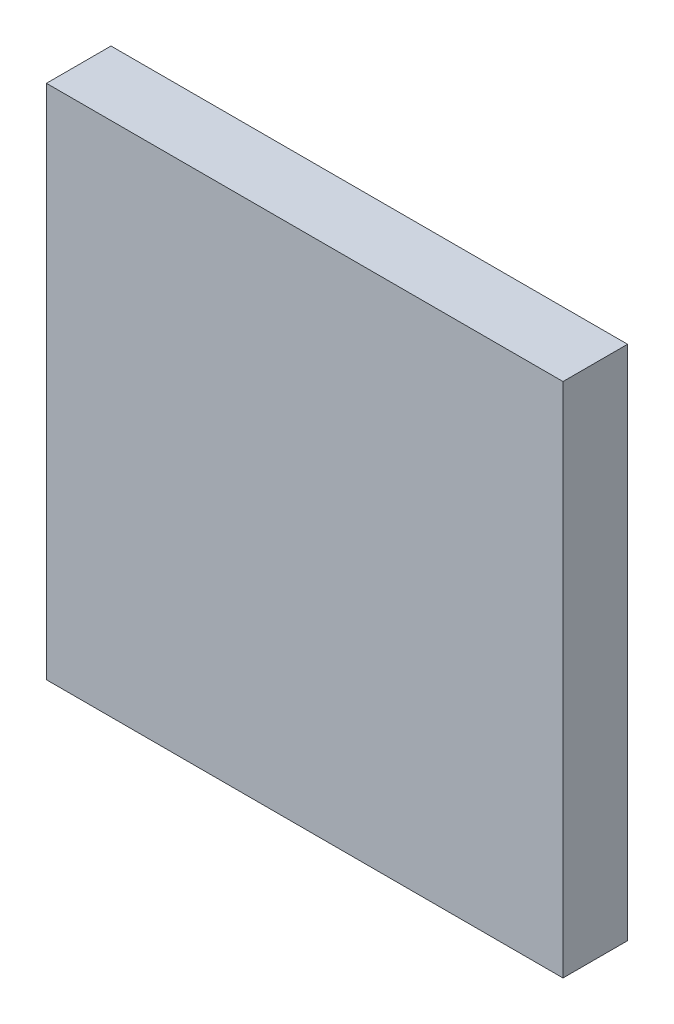
ISO-10303-21;
HEADER;
FILE_DESCRIPTION(('STEP AP214'),'2;1');
FILE_NAME('part.step','',(''),(''),'','','');
FILE_SCHEMA(('AUTOMOTIVE_DESIGN { 1 0 10303 214 1 1 1 1 }'));
ENDSEC;
DATA;
#1=APPLICATION_CONTEXT('core data for automotive mechanical design processes');
#2=APPLICATION_PROTOCOL_DEFINITION('international standard','automotive_design',2000,#1);
#3=PRODUCT_CONTEXT('',#1,'mechanical');
#4=PRODUCT('Part','Part','',(#3));
#5=PRODUCT_RELATED_PRODUCT_CATEGORY('part','',(#4));
#6=PRODUCT_DEFINITION_FORMATION('','',#4);
#7=PRODUCT_DEFINITION_CONTEXT('part definition',#1,'design');
#8=PRODUCT_DEFINITION('design','',#6,#7);
#9=PRODUCT_DEFINITION_SHAPE('','',#8);
#10=(LENGTH_UNIT() NAMED_UNIT(*) SI_UNIT(.MILLI.,.METRE.));
#11=(NAMED_UNIT(*) PLANE_ANGLE_UNIT() SI_UNIT($,.RADIAN.));
#12=(NAMED_UNIT(*) SI_UNIT($,.STERADIAN.) SOLID_ANGLE_UNIT());
#13=UNCERTAINTY_MEASURE_WITH_UNIT(LENGTH_MEASURE(1.E-05),#10,'distance_accuracy_value','');
#14=(GEOMETRIC_REPRESENTATION_CONTEXT(3) GLOBAL_UNCERTAINTY_ASSIGNED_CONTEXT((#13)) GLOBAL_UNIT_ASSIGNED_CONTEXT((#10,
#11,#12)) REPRESENTATION_CONTEXT('',''));
#15=CARTESIAN_POINT('',(0.,0.,0.));
#16=DIRECTION('',(0.,0.,1.));
#17=DIRECTION('',(1.,0.,0.));
#18=AXIS2_PLACEMENT_3D('',#15,#16,#17);
#19=CARTESIAN_POINT('',(20.,20.,5.));
#20=DIRECTION('',(-1.,0.,0.));
#21=DIRECTION('',(0.,-1.,0.));
#22=AXIS2_PLACEMENT_3D('',#19,#20,#21);
#23=PLANE('',#22);
#24=DIRECTION('',(0.,1.,0.));
#25=VECTOR('',#24,1.);
#26=CARTESIAN_POINT('',(20.,20.,0.));
#27=LINE('',#26,#25);
#28=CARTESIAN_POINT('',(20.,-20.,0.));
#29=VERTEX_POINT('',#28);
#30=CARTESIAN_POINT('',(20.,20.,0.));
#31=VERTEX_POINT('',#30);
#32=EDGE_CURVE('E96',#29,#31,#27,.T.);
#33=ORIENTED_EDGE('',*,*,#32,.T.);
#34=DIRECTION('',(0.,0.,-1.));
#35=VECTOR('',#34,1.);
#36=CARTESIAN_POINT('',(20.,20.,5.));
#37=LINE('',#36,#35);
#38=CARTESIAN_POINT('',(20.,20.,5.));
#39=VERTEX_POINT('',#38);
#40=EDGE_CURVE('E11',#39,#31,#37,.T.);
#41=ORIENTED_EDGE('',*,*,#40,.F.);
#42=DIRECTION('',(0.,1.,0.));
#43=VECTOR('',#42,1.);
#44=CARTESIAN_POINT('',(20.,20.,5.));
#45=LINE('',#44,#43);
#46=CARTESIAN_POINT('',(20.,-20.,5.));
#47=VERTEX_POINT('',#46);
#48=EDGE_CURVE('E84',#47,#39,#45,.T.);
#49=ORIENTED_EDGE('',*,*,#48,.F.);
#50=DIRECTION('',(0.,0.,-1.));
#51=VECTOR('',#50,1.);
#52=CARTESIAN_POINT('',(20.,-20.,5.));
#53=LINE('',#52,#51);
#54=EDGE_CURVE('E92',#47,#29,#53,.T.);
#55=ORIENTED_EDGE('',*,*,#54,.T.);
#56=EDGE_LOOP('',(#33,#41,#49,#55));
#57=FACE_BOUND('',#56,.T.);
#58=ADVANCED_FACE('F33',(#57),#23,.F.);
#59=CARTESIAN_POINT('',(-20.,20.,5.));
#60=DIRECTION('',(0.,-1.,0.));
#61=DIRECTION('',(0.,0.,-1.));
#62=AXIS2_PLACEMENT_3D('',#59,#60,#61);
#63=PLANE('',#62);
#64=DIRECTION('',(-1.,0.,0.));
#65=VECTOR('',#64,1.);
#66=CARTESIAN_POINT('',(-20.,20.,0.));
#67=LINE('',#66,#65);
#68=CARTESIAN_POINT('',(-20.,20.,0.));
#69=VERTEX_POINT('',#68);
#70=EDGE_CURVE('E88',#31,#69,#67,.T.);
#71=ORIENTED_EDGE('',*,*,#70,.T.);
#72=DIRECTION('',(0.,0.,-1.));
#73=VECTOR('',#72,1.);
#74=CARTESIAN_POINT('',(-20.,20.,5.));
#75=LINE('',#74,#73);
#76=CARTESIAN_POINT('',(-20.,20.,5.));
#77=VERTEX_POINT('',#76);
#78=EDGE_CURVE('E41',#77,#69,#75,.T.);
#79=ORIENTED_EDGE('',*,*,#78,.F.);
#80=DIRECTION('',(-1.,0.,0.));
#81=VECTOR('',#80,1.);
#82=CARTESIAN_POINT('',(-20.,20.,5.));
#83=LINE('',#82,#81);
#84=EDGE_CURVE('E79',#39,#77,#83,.T.);
#85=ORIENTED_EDGE('',*,*,#84,.F.);
#86=ORIENTED_EDGE('',*,*,#40,.T.);
#87=EDGE_LOOP('',(#71,#79,#85,#86));
#88=FACE_BOUND('',#87,.T.);
#89=ADVANCED_FACE('F87',(#88),#63,.F.);
#90=CARTESIAN_POINT('',(-20.,20.,5.));
#91=DIRECTION('',(1.,0.,0.));
#92=DIRECTION('',(0.,1.,0.));
#93=AXIS2_PLACEMENT_3D('',#90,#91,#92);
#94=PLANE('',#93);
#95=DIRECTION('',(0.,-1.,0.));
#96=VECTOR('',#95,1.);
#97=CARTESIAN_POINT('',(-20.,20.,0.));
#98=LINE('',#97,#96);
#99=CARTESIAN_POINT('',(-20.,-20.,0.));
#100=VERTEX_POINT('',#99);
#101=EDGE_CURVE('E66',#69,#100,#98,.T.);
#102=ORIENTED_EDGE('',*,*,#101,.T.);
#103=DIRECTION('',(0.,0.,-1.));
#104=VECTOR('',#103,1.);
#105=CARTESIAN_POINT('',(-20.,-20.,5.));
#106=LINE('',#105,#104);
#107=CARTESIAN_POINT('',(-20.,-20.,5.));
#108=VERTEX_POINT('',#107);
#109=EDGE_CURVE('E89',#108,#100,#106,.T.);
#110=ORIENTED_EDGE('',*,*,#109,.F.);
#111=DIRECTION('',(0.,-1.,0.));
#112=VECTOR('',#111,1.);
#113=CARTESIAN_POINT('',(-20.,20.,5.));
#114=LINE('',#113,#112);
#115=EDGE_CURVE('E82',#77,#108,#114,.T.);
#116=ORIENTED_EDGE('',*,*,#115,.F.);
#117=ORIENTED_EDGE('',*,*,#78,.T.);
#118=EDGE_LOOP('',(#102,#110,#116,#117));
#119=FACE_BOUND('',#118,.T.);
#120=ADVANCED_FACE('F90',(#119),#94,.F.);
#121=CARTESIAN_POINT('',(-20.,-20.,5.));
#122=DIRECTION('',(0.,1.,0.));
#123=DIRECTION('',(0.,0.,1.));
#124=AXIS2_PLACEMENT_3D('',#121,#122,#123);
#125=PLANE('',#124);
#126=DIRECTION('',(1.,0.,0.));
#127=VECTOR('',#126,1.);
#128=CARTESIAN_POINT('',(-20.,-20.,0.));
#129=LINE('',#128,#127);
#130=EDGE_CURVE('E72',#100,#29,#129,.T.);
#131=ORIENTED_EDGE('',*,*,#130,.T.);
#132=ORIENTED_EDGE('',*,*,#54,.F.);
#133=DIRECTION('',(1.,0.,0.));
#134=VECTOR('',#133,1.);
#135=CARTESIAN_POINT('',(-20.,-20.,5.));
#136=LINE('',#135,#134);
#137=EDGE_CURVE('E49',#108,#47,#136,.T.);
#138=ORIENTED_EDGE('',*,*,#137,.F.);
#139=ORIENTED_EDGE('',*,*,#109,.T.);
#140=EDGE_LOOP('',(#131,#132,#138,#139));
#141=FACE_BOUND('',#140,.T.);
#142=ADVANCED_FACE('F103',(#141),#125,.F.);
#143=CARTESIAN_POINT('',(0.,0.,5.));
#144=DIRECTION('',(0.,0.,1.));
#145=DIRECTION('',(1.,0.,0.));
#146=AXIS2_PLACEMENT_3D('',#143,#144,#145);
#147=PLANE('',#146);
#148=ORIENTED_EDGE('',*,*,#48,.T.);
#149=ORIENTED_EDGE('',*,*,#84,.T.);
#150=ORIENTED_EDGE('',*,*,#115,.T.);
#151=ORIENTED_EDGE('',*,*,#137,.T.);
#152=EDGE_LOOP('',(#148,#149,#150,#151));
#153=FACE_BOUND('',#152,.T.);
#154=ADVANCED_FACE('F80',(#153),#147,.T.);
#155=CARTESIAN_POINT('',(0.,0.,0.));
#156=DIRECTION('',(0.,0.,1.));
#157=DIRECTION('',(1.,0.,0.));
#158=AXIS2_PLACEMENT_3D('',#155,#156,#157);
#159=PLANE('',#158);
#160=ORIENTED_EDGE('',*,*,#32,.F.);
#161=ORIENTED_EDGE('',*,*,#130,.F.);
#162=ORIENTED_EDGE('',*,*,#101,.F.);
#163=ORIENTED_EDGE('',*,*,#70,.F.);
#164=EDGE_LOOP('',(#160,#161,#162,#163));
#165=FACE_BOUND('',#164,.T.);
#166=ADVANCED_FACE('F106',(#165),#159,.F.);
#167=CLOSED_SHELL('',(#58,#89,#120,#142,#154,#166));
#168=MANIFOLD_SOLID_BREP('B2',#167);
#169=ADVANCED_BREP_SHAPE_REPRESENTATION('',(#18,#168),#14);
#170=SHAPE_DEFINITION_REPRESENTATION(#9,#169);
ENDSEC;
END-ISO-10303-21;
